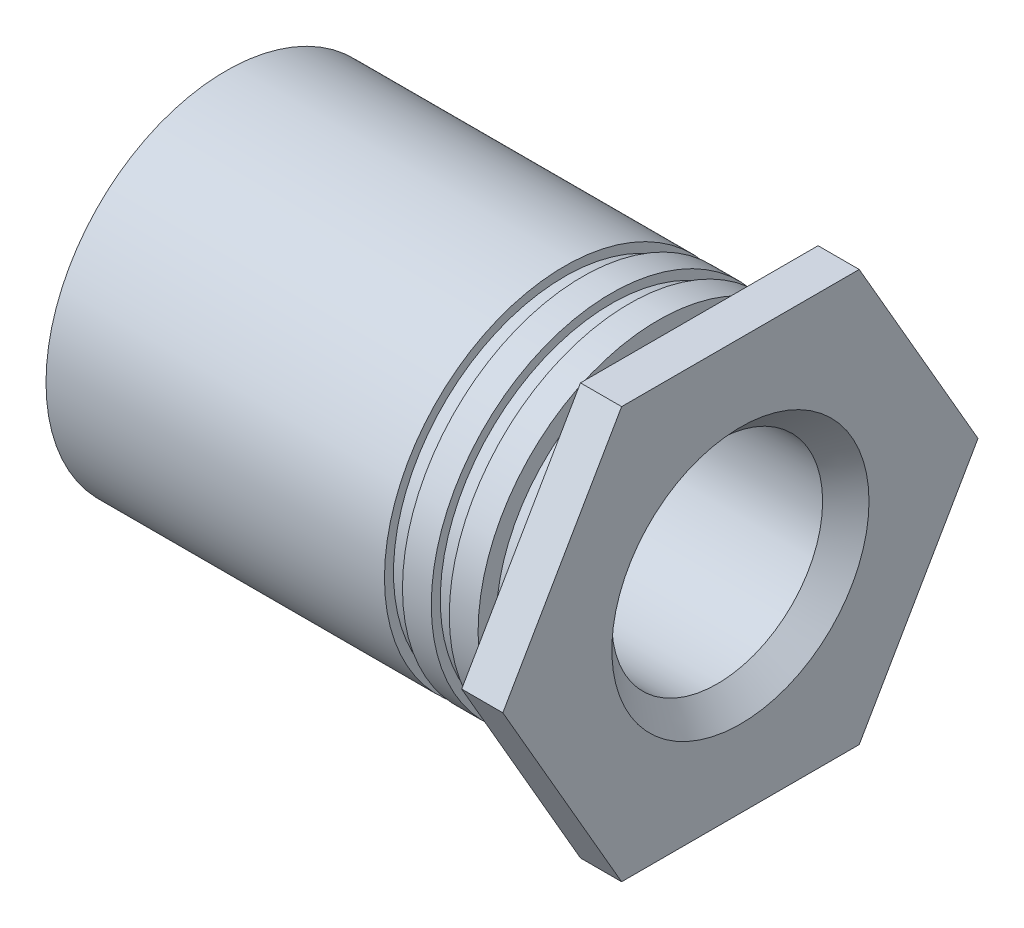
ISO-10303-21;
HEADER;
FILE_DESCRIPTION(('STEP AP214'),'2;1');
FILE_NAME('part.step','',(''),(''),'','','');
FILE_SCHEMA(('AUTOMOTIVE_DESIGN { 1 0 10303 214 1 1 1 1 }'));
ENDSEC;
DATA;
#1=APPLICATION_CONTEXT('core data for automotive mechanical design processes');
#2=APPLICATION_PROTOCOL_DEFINITION('international standard','automotive_design',2000,#1);
#3=PRODUCT_CONTEXT('',#1,'mechanical');
#4=PRODUCT('Part','Part','',(#3));
#5=PRODUCT_RELATED_PRODUCT_CATEGORY('part','',(#4));
#6=PRODUCT_DEFINITION_FORMATION('','',#4);
#7=PRODUCT_DEFINITION_CONTEXT('part definition',#1,'design');
#8=PRODUCT_DEFINITION('design','',#6,#7);
#9=PRODUCT_DEFINITION_SHAPE('','',#8);
#10=(LENGTH_UNIT() NAMED_UNIT(*) SI_UNIT(.MILLI.,.METRE.));
#11=(NAMED_UNIT(*) PLANE_ANGLE_UNIT() SI_UNIT($,.RADIAN.));
#12=(NAMED_UNIT(*) SI_UNIT($,.STERADIAN.) SOLID_ANGLE_UNIT());
#13=UNCERTAINTY_MEASURE_WITH_UNIT(LENGTH_MEASURE(1.E-05),#10,'distance_accuracy_value','');
#14=(GEOMETRIC_REPRESENTATION_CONTEXT(3) GLOBAL_UNCERTAINTY_ASSIGNED_CONTEXT((#13)) GLOBAL_UNIT_ASSIGNED_CONTEXT((#10,
#11,#12)) REPRESENTATION_CONTEXT('',''));
#15=CARTESIAN_POINT('',(0.,0.,0.));
#16=DIRECTION('',(0.,0.,1.));
#17=DIRECTION('',(1.,0.,0.));
#18=AXIS2_PLACEMENT_3D('',#15,#16,#17);
#19=CARTESIAN_POINT('',(-0.48,0.,1.05));
#20=DIRECTION('',(1.,0.,0.));
#21=DIRECTION('',(0.,0.,-1.));
#22=AXIS2_PLACEMENT_3D('',#19,#20,#21);
#23=PLANE('',#22);
#24=CARTESIAN_POINT('',(-0.48,0.,0.));
#25=DIRECTION('',(1.,0.,0.));
#26=DIRECTION('',(0.,0.,-1.));
#27=AXIS2_PLACEMENT_3D('',#24,#25,#26);
#28=CIRCLE('',#27,2.1);
#29=CARTESIAN_POINT('',(-0.48,0.,-2.1));
#30=VERTEX_POINT('',#29);
#31=EDGE_CURVE('E19',#30,#30,#28,.F.);
#32=ORIENTED_EDGE('',*,*,#31,.F.);
#33=EDGE_LOOP('',(#32));
#34=FACE_BOUND('',#33,.T.);
#35=CARTESIAN_POINT('',(-0.48,0.,0.));
#36=DIRECTION('',(1.,0.,0.));
#37=DIRECTION('',(0.,0.,-1.));
#38=AXIS2_PLACEMENT_3D('',#35,#36,#37);
#39=CIRCLE('',#38,1.89);
#40=CARTESIAN_POINT('',(-0.479999999999999,0.,-1.89));
#41=VERTEX_POINT('',#40);
#42=EDGE_CURVE('E129',#41,#41,#39,.T.);
#43=ORIENTED_EDGE('',*,*,#42,.F.);
#44=EDGE_LOOP('',(#43));
#45=FACE_BOUND('',#44,.T.);
#46=ADVANCED_FACE('F16',(#34,#45),#23,.T.);
#47=CARTESIAN_POINT('',(-3.,0.,0.));
#48=DIRECTION('',(1.,0.,0.));
#49=DIRECTION('',(0.,0.,-1.));
#50=AXIS2_PLACEMENT_3D('',#47,#48,#49);
#51=CYLINDRICAL_SURFACE('',#50,2.1);
#52=CARTESIAN_POINT('',(-0.816,0.,0.));
#53=DIRECTION('',(1.,0.,0.));
#54=DIRECTION('',(0.,0.,-1.));
#55=AXIS2_PLACEMENT_3D('',#52,#53,#54);
#56=CIRCLE('',#55,2.1);
#57=CARTESIAN_POINT('',(-0.816,0.,-2.1));
#58=VERTEX_POINT('',#57);
#59=EDGE_CURVE('E127',#58,#58,#56,.T.);
#60=ORIENTED_EDGE('',*,*,#59,.T.);
#61=EDGE_LOOP('',(#60));
#62=FACE_BOUND('',#61,.T.);
#63=ORIENTED_EDGE('',*,*,#31,.T.);
#64=EDGE_LOOP('',(#63));
#65=FACE_BOUND('',#64,.T.);
#66=ADVANCED_FACE('F136',(#62,#65),#51,.T.);
#67=CARTESIAN_POINT('',(-0.24,0.,0.));
#68=DIRECTION('',(1.,0.,0.));
#69=DIRECTION('',(0.,0.,-1.));
#70=AXIS2_PLACEMENT_3D('',#67,#68,#69);
#71=CYLINDRICAL_SURFACE('',#70,1.89);
#72=ORIENTED_EDGE('',*,*,#42,.T.);
#73=EDGE_LOOP('',(#72));
#74=FACE_BOUND('',#73,.T.);
#75=CARTESIAN_POINT('',(0.,0.,0.));
#76=DIRECTION('',(1.,0.,0.));
#77=DIRECTION('',(0.,0.,-1.));
#78=AXIS2_PLACEMENT_3D('',#75,#76,#77);
#79=CIRCLE('',#78,1.89);
#80=CARTESIAN_POINT('',(0.,0.,-1.89));
#81=VERTEX_POINT('',#80);
#82=EDGE_CURVE('E124',#81,#81,#79,.F.);
#83=ORIENTED_EDGE('',*,*,#82,.T.);
#84=EDGE_LOOP('',(#83));
#85=FACE_BOUND('',#84,.T.);
#86=ADVANCED_FACE('F144',(#74,#85),#71,.T.);
#87=CARTESIAN_POINT('',(-0.816000000000001,0.,2.0475));
#88=DIRECTION('',(1.,0.,0.));
#89=DIRECTION('',(0.,0.,-1.));
#90=AXIS2_PLACEMENT_3D('',#87,#88,#89);
#91=PLANE('',#90);
#92=ORIENTED_EDGE('',*,*,#59,.F.);
#93=EDGE_LOOP('',(#92));
#94=FACE_BOUND('',#93,.T.);
#95=CARTESIAN_POINT('',(-0.816,0.,0.));
#96=DIRECTION('',(1.,0.,0.));
#97=DIRECTION('',(0.,0.,-1.));
#98=AXIS2_PLACEMENT_3D('',#95,#96,#97);
#99=CIRCLE('',#98,1.995);
#100=CARTESIAN_POINT('',(-0.816,0.,-1.995));
#101=VERTEX_POINT('',#100);
#102=EDGE_CURVE('E80',#101,#101,#99,.F.);
#103=ORIENTED_EDGE('',*,*,#102,.F.);
#104=EDGE_LOOP('',(#103));
#105=FACE_BOUND('',#104,.T.);
#106=ADVANCED_FACE('F219',(#94,#105),#91,.F.);
#107=CARTESIAN_POINT('',(0.,0.,0.));
#108=DIRECTION('',(1.,0.,0.));
#109=DIRECTION('',(0.,1.,0.));
#110=AXIS2_PLACEMENT_3D('',#107,#108,#109);
#111=PLANE('',#110);
#112=ORIENTED_EDGE('',*,*,#82,.F.);
#113=EDGE_LOOP('',(#112));
#114=FACE_BOUND('',#113,.T.);
#115=DIRECTION('',(0.,0.,1.));
#116=VECTOR('',#115,1.);
#117=CARTESIAN_POINT('',(0.,2.4,1.3856406460551));
#118=LINE('',#117,#116);
#119=CARTESIAN_POINT('',(0.,2.4,-1.3856406460551));
#120=VERTEX_POINT('',#119);
#121=CARTESIAN_POINT('',(0.,2.4,1.3856406460551));
#122=VERTEX_POINT('',#121);
#123=EDGE_CURVE('E71',#120,#122,#118,.T.);
#124=ORIENTED_EDGE('',*,*,#123,.F.);
#125=DIRECTION('',(0.,0.866025403784439,0.5));
#126=VECTOR('',#125,1.);
#127=CARTESIAN_POINT('',(0.,2.4,-1.3856406460551));
#128=LINE('',#127,#126);
#129=CARTESIAN_POINT('',(0.,0.,-2.7712812921102));
#130=VERTEX_POINT('',#129);
#131=EDGE_CURVE('E420',#130,#120,#128,.T.);
#132=ORIENTED_EDGE('',*,*,#131,.F.);
#133=DIRECTION('',(0.,0.866025403784438,-0.5));
#134=VECTOR('',#133,1.);
#135=CARTESIAN_POINT('',(0.,0.,-2.7712812921102));
#136=LINE('',#135,#134);
#137=CARTESIAN_POINT('',(0.,-2.4,-1.3856406460551));
#138=VERTEX_POINT('',#137);
#139=EDGE_CURVE('E408',#138,#130,#136,.T.);
#140=ORIENTED_EDGE('',*,*,#139,.F.);
#141=DIRECTION('',(0.,0.,-1.));
#142=VECTOR('',#141,1.);
#143=CARTESIAN_POINT('',(0.,-2.4,-1.3856406460551));
#144=LINE('',#143,#142);
#145=CARTESIAN_POINT('',(0.,-2.4,1.3856406460551));
#146=VERTEX_POINT('',#145);
#147=EDGE_CURVE('E407',#146,#138,#144,.T.);
#148=ORIENTED_EDGE('',*,*,#147,.F.);
#149=DIRECTION('',(0.,-0.866025403784439,-0.5));
#150=VECTOR('',#149,1.);
#151=CARTESIAN_POINT('',(0.,-2.4,1.3856406460551));
#152=LINE('',#151,#150);
#153=CARTESIAN_POINT('',(0.,0.,2.7712812921102));
#154=VERTEX_POINT('',#153);
#155=EDGE_CURVE('E84',#154,#146,#152,.T.);
#156=ORIENTED_EDGE('',*,*,#155,.F.);
#157=DIRECTION('',(0.,-0.866025403784439,0.5));
#158=VECTOR('',#157,1.);
#159=CARTESIAN_POINT('',(0.,0.,2.7712812921102));
#160=LINE('',#159,#158);
#161=EDGE_CURVE('E66',#122,#154,#160,.T.);
#162=ORIENTED_EDGE('',*,*,#161,.F.);
#163=EDGE_LOOP('',(#124,#132,#140,#148,#156,#162));
#164=FACE_BOUND('',#163,.T.);
#165=ADVANCED_FACE('F82',(#114,#164),#111,.F.);
#166=CARTESIAN_POINT('',(-0.921,0.,0.));
#167=DIRECTION('',(1.,0.,0.));
#168=DIRECTION('',(0.,0.,-1.));
#169=AXIS2_PLACEMENT_3D('',#166,#167,#168);
#170=CYLINDRICAL_SURFACE('',#169,1.995);
#171=CARTESIAN_POINT('',(-1.026,0.,0.));
#172=DIRECTION('',(1.,0.,0.));
#173=DIRECTION('',(0.,0.,-1.));
#174=AXIS2_PLACEMENT_3D('',#171,#172,#173);
#175=CIRCLE('',#174,1.995);
#176=CARTESIAN_POINT('',(-1.026,0.,-1.995));
#177=VERTEX_POINT('',#176);
#178=EDGE_CURVE('E118',#177,#177,#175,.T.);
#179=ORIENTED_EDGE('',*,*,#178,.T.);
#180=EDGE_LOOP('',(#179));
#181=FACE_BOUND('',#180,.T.);
#182=ORIENTED_EDGE('',*,*,#102,.T.);
#183=EDGE_LOOP('',(#182));
#184=FACE_BOUND('',#183,.T.);
#185=ADVANCED_FACE('F213',(#181,#184),#170,.T.);
#186=CARTESIAN_POINT('',(0.,2.4,1.3856406460551));
#187=DIRECTION('',(0.,1.,0.));
#188=DIRECTION('',(0.,0.,1.));
#189=AXIS2_PLACEMENT_3D('',#186,#187,#188);
#190=PLANE('',#189);
#191=ORIENTED_EDGE('',*,*,#123,.T.);
#192=DIRECTION('',(1.,0.,0.));
#193=VECTOR('',#192,1.);
#194=CARTESIAN_POINT('',(0.,2.4,1.3856406460551));
#195=LINE('',#194,#193);
#196=CARTESIAN_POINT('',(0.48,2.4,1.3856406460551));
#197=VERTEX_POINT('',#196);
#198=EDGE_CURVE('E73',#197,#122,#195,.F.);
#199=ORIENTED_EDGE('',*,*,#198,.F.);
#200=DIRECTION('',(0.,0.,1.));
#201=VECTOR('',#200,1.);
#202=CARTESIAN_POINT('',(0.48,2.4,0.));
#203=LINE('',#202,#201);
#204=CARTESIAN_POINT('',(0.48,2.4,-1.3856406460551));
#205=VERTEX_POINT('',#204);
#206=EDGE_CURVE('E121',#205,#197,#203,.T.);
#207=ORIENTED_EDGE('',*,*,#206,.F.);
#208=DIRECTION('',(1.,0.,0.));
#209=VECTOR('',#208,1.);
#210=CARTESIAN_POINT('',(0.,2.4,-1.3856406460551));
#211=LINE('',#210,#209);
#212=EDGE_CURVE('E76',#120,#205,#211,.T.);
#213=ORIENTED_EDGE('',*,*,#212,.F.);
#214=EDGE_LOOP('',(#191,#199,#207,#213));
#215=FACE_BOUND('',#214,.T.);
#216=ADVANCED_FACE('F72',(#215),#190,.T.);
#217=CARTESIAN_POINT('',(0.,0.,2.7712812921102));
#218=DIRECTION('',(0.,0.5,0.866025403784439));
#219=DIRECTION('',(0.,-0.866025403784439,0.5));
#220=AXIS2_PLACEMENT_3D('',#217,#218,#219);
#221=PLANE('',#220);
#222=ORIENTED_EDGE('',*,*,#161,.T.);
#223=DIRECTION('',(1.,0.,0.));
#224=VECTOR('',#223,1.);
#225=CARTESIAN_POINT('',(0.,0.,2.7712812921102));
#226=LINE('',#225,#224);
#227=CARTESIAN_POINT('',(0.48,0.,2.7712812921102));
#228=VERTEX_POINT('',#227);
#229=EDGE_CURVE('E86',#228,#154,#226,.F.);
#230=ORIENTED_EDGE('',*,*,#229,.F.);
#231=DIRECTION('',(0.,-0.866025403784439,0.5));
#232=VECTOR('',#231,1.);
#233=CARTESIAN_POINT('',(0.48,2.4,1.3856406460551));
#234=LINE('',#233,#232);
#235=EDGE_CURVE('E90',#197,#228,#234,.T.);
#236=ORIENTED_EDGE('',*,*,#235,.F.);
#237=ORIENTED_EDGE('',*,*,#198,.T.);
#238=EDGE_LOOP('',(#222,#230,#236,#237));
#239=FACE_BOUND('',#238,.T.);
#240=ADVANCED_FACE('F88',(#239),#221,.T.);
#241=CARTESIAN_POINT('',(0.,-2.4,1.3856406460551));
#242=DIRECTION('',(0.,-0.5,0.866025403784439));
#243=DIRECTION('',(0.,-0.866025403784439,-0.5));
#244=AXIS2_PLACEMENT_3D('',#241,#242,#243);
#245=PLANE('',#244);
#246=ORIENTED_EDGE('',*,*,#155,.T.);
#247=DIRECTION('',(1.,0.,0.));
#248=VECTOR('',#247,1.);
#249=CARTESIAN_POINT('',(0.,-2.4,1.3856406460551));
#250=LINE('',#249,#248);
#251=CARTESIAN_POINT('',(0.48,-2.4,1.3856406460551));
#252=VERTEX_POINT('',#251);
#253=EDGE_CURVE('E403',#252,#146,#250,.F.);
#254=ORIENTED_EDGE('',*,*,#253,.F.);
#255=DIRECTION('',(0.,-0.866025403784439,-0.5));
#256=VECTOR('',#255,1.);
#257=CARTESIAN_POINT('',(0.48,0.,2.7712812921102));
#258=LINE('',#257,#256);
#259=EDGE_CURVE('E425',#228,#252,#258,.T.);
#260=ORIENTED_EDGE('',*,*,#259,.F.);
#261=ORIENTED_EDGE('',*,*,#229,.T.);
#262=EDGE_LOOP('',(#246,#254,#260,#261));
#263=FACE_BOUND('',#262,.T.);
#264=ADVANCED_FACE('F204',(#263),#245,.T.);
#265=CARTESIAN_POINT('',(0.,-2.4,-1.3856406460551));
#266=DIRECTION('',(0.,-1.,0.));
#267=DIRECTION('',(0.,0.,-1.));
#268=AXIS2_PLACEMENT_3D('',#265,#266,#267);
#269=PLANE('',#268);
#270=ORIENTED_EDGE('',*,*,#147,.T.);
#271=DIRECTION('',(1.,0.,0.));
#272=VECTOR('',#271,1.);
#273=CARTESIAN_POINT('',(0.,-2.4,-1.3856406460551));
#274=LINE('',#273,#272);
#275=CARTESIAN_POINT('',(0.48,-2.4,-1.3856406460551));
#276=VERTEX_POINT('',#275);
#277=EDGE_CURVE('E410',#276,#138,#274,.F.);
#278=ORIENTED_EDGE('',*,*,#277,.F.);
#279=DIRECTION('',(0.,0.,1.));
#280=VECTOR('',#279,1.);
#281=CARTESIAN_POINT('',(0.48,-2.4,0.));
#282=LINE('',#281,#280);
#283=EDGE_CURVE('E413',#252,#276,#282,.F.);
#284=ORIENTED_EDGE('',*,*,#283,.F.);
#285=ORIENTED_EDGE('',*,*,#253,.T.);
#286=EDGE_LOOP('',(#270,#278,#284,#285));
#287=FACE_BOUND('',#286,.T.);
#288=ADVANCED_FACE('F201',(#287),#269,.T.);
#289=CARTESIAN_POINT('',(0.,0.,-2.7712812921102));
#290=DIRECTION('',(0.,-0.5,-0.866025403784438));
#291=DIRECTION('',(0.,0.866025403784438,-0.5));
#292=AXIS2_PLACEMENT_3D('',#289,#290,#291);
#293=PLANE('',#292);
#294=ORIENTED_EDGE('',*,*,#139,.T.);
#295=DIRECTION('',(1.,0.,0.));
#296=VECTOR('',#295,1.);
#297=CARTESIAN_POINT('',(0.,0.,-2.7712812921102));
#298=LINE('',#297,#296);
#299=CARTESIAN_POINT('',(0.48,0.,-2.7712812921102));
#300=VERTEX_POINT('',#299);
#301=EDGE_CURVE('E34',#300,#130,#298,.F.);
#302=ORIENTED_EDGE('',*,*,#301,.F.);
#303=DIRECTION('',(0.,0.866025403784439,-0.5));
#304=VECTOR('',#303,1.);
#305=CARTESIAN_POINT('',(0.48,-2.4,-1.3856406460551));
#306=LINE('',#305,#304);
#307=EDGE_CURVE('E428',#276,#300,#306,.T.);
#308=ORIENTED_EDGE('',*,*,#307,.F.);
#309=ORIENTED_EDGE('',*,*,#277,.T.);
#310=EDGE_LOOP('',(#294,#302,#308,#309));
#311=FACE_BOUND('',#310,.T.);
#312=ADVANCED_FACE('F197',(#311),#293,.T.);
#313=CARTESIAN_POINT('',(0.,2.4,-1.3856406460551));
#314=DIRECTION('',(0.,0.5,-0.866025403784439));
#315=DIRECTION('',(0.,0.866025403784439,0.5));
#316=AXIS2_PLACEMENT_3D('',#313,#314,#315);
#317=PLANE('',#316);
#318=ORIENTED_EDGE('',*,*,#131,.T.);
#319=ORIENTED_EDGE('',*,*,#212,.T.);
#320=DIRECTION('',(0.,0.866025403784439,0.499999999999999));
#321=VECTOR('',#320,1.);
#322=CARTESIAN_POINT('',(0.48,0.,-2.7712812921102));
#323=LINE('',#322,#321);
#324=EDGE_CURVE('E117',#300,#205,#323,.T.);
#325=ORIENTED_EDGE('',*,*,#324,.F.);
#326=ORIENTED_EDGE('',*,*,#301,.T.);
#327=EDGE_LOOP('',(#318,#319,#325,#326));
#328=FACE_BOUND('',#327,.T.);
#329=ADVANCED_FACE('F193',(#328),#317,.T.);
#330=CARTESIAN_POINT('',(-1.026,0.,2.0475));
#331=DIRECTION('',(-1.,0.,0.));
#332=DIRECTION('',(0.,0.,1.));
#333=AXIS2_PLACEMENT_3D('',#330,#331,#332);
#334=PLANE('',#333);
#335=ORIENTED_EDGE('',*,*,#178,.F.);
#336=EDGE_LOOP('',(#335));
#337=FACE_BOUND('',#336,.T.);
#338=CARTESIAN_POINT('',(-1.026,0.,0.));
#339=DIRECTION('',(1.,0.,0.));
#340=DIRECTION('',(0.,0.,-1.));
#341=AXIS2_PLACEMENT_3D('',#338,#339,#340);
#342=CIRCLE('',#341,2.1);
#343=CARTESIAN_POINT('',(-1.026,0.,-2.1));
#344=VERTEX_POINT('',#343);
#345=EDGE_CURVE('E114',#344,#344,#342,.F.);
#346=ORIENTED_EDGE('',*,*,#345,.F.);
#347=EDGE_LOOP('',(#346));
#348=FACE_BOUND('',#347,.T.);
#349=ADVANCED_FACE('F189',(#337,#348),#334,.F.);
#350=CARTESIAN_POINT('',(0.48,0.,0.));
#351=DIRECTION('',(1.,0.,0.));
#352=DIRECTION('',(0.,1.,0.));
#353=AXIS2_PLACEMENT_3D('',#350,#351,#352);
#354=PLANE('',#353);
#355=ORIENTED_EDGE('',*,*,#307,.T.);
#356=ORIENTED_EDGE('',*,*,#324,.T.);
#357=ORIENTED_EDGE('',*,*,#206,.T.);
#358=ORIENTED_EDGE('',*,*,#235,.T.);
#359=ORIENTED_EDGE('',*,*,#259,.T.);
#360=ORIENTED_EDGE('',*,*,#283,.T.);
#361=EDGE_LOOP('',(#355,#356,#357,#358,#359,#360));
#362=FACE_BOUND('',#361,.T.);
#363=CARTESIAN_POINT('',(0.479999999981828,0.,0.));
#364=DIRECTION('',(1.,0.,0.));
#365=DIRECTION('',(0.,0.,-1.));
#366=AXIS2_PLACEMENT_3D('',#363,#364,#365);
#367=CIRCLE('',#366,1.49999999996453);
#368=CARTESIAN_POINT('',(0.479999999981828,0.,-1.49999999996453));
#369=VERTEX_POINT('',#368);
#370=EDGE_CURVE('E111',#369,#369,#367,.F.);
#371=ORIENTED_EDGE('',*,*,#370,.T.);
#372=EDGE_LOOP('',(#371));
#373=FACE_BOUND('',#372,.T.);
#374=ADVANCED_FACE('F185',(#362,#373),#354,.T.);
#375=CARTESIAN_POINT('',(-3.,0.,0.));
#376=DIRECTION('',(1.,0.,0.));
#377=DIRECTION('',(0.,0.,-1.));
#378=AXIS2_PLACEMENT_3D('',#375,#376,#377);
#379=CYLINDRICAL_SURFACE('',#378,2.1);
#380=CARTESIAN_POINT('',(-1.362,0.,0.));
#381=DIRECTION('',(1.,0.,0.));
#382=DIRECTION('',(0.,0.,-1.));
#383=AXIS2_PLACEMENT_3D('',#380,#381,#382);
#384=CIRCLE('',#383,2.1);
#385=CARTESIAN_POINT('',(-1.362,0.,-2.1));
#386=VERTEX_POINT('',#385);
#387=EDGE_CURVE('E108',#386,#386,#384,.T.);
#388=ORIENTED_EDGE('',*,*,#387,.T.);
#389=EDGE_LOOP('',(#388));
#390=FACE_BOUND('',#389,.T.);
#391=ORIENTED_EDGE('',*,*,#345,.T.);
#392=EDGE_LOOP('',(#391));
#393=FACE_BOUND('',#392,.T.);
#394=ADVANCED_FACE('F181',(#390,#393),#379,.T.);
#395=CARTESIAN_POINT('',(0.479999999981828,0.,0.));
#396=DIRECTION('',(1.,0.,0.));
#397=DIRECTION('',(0.,0.,-1.));
#398=AXIS2_PLACEMENT_3D('',#395,#396,#397);
#399=CONICAL_SURFACE('',#398,1.49999999996453,0.785398163397448);
#400=ORIENTED_EDGE('',*,*,#370,.F.);
#401=EDGE_LOOP('',(#400));
#402=FACE_BOUND('',#401,.T.);
#403=CARTESIAN_POINT('',(0.2095,0.,0.));
#404=DIRECTION('',(1.,0.,0.));
#405=DIRECTION('',(0.,0.,-1.));
#406=AXIS2_PLACEMENT_3D('',#403,#404,#405);
#407=CIRCLE('',#406,1.2295);
#408=CARTESIAN_POINT('',(0.2095,0.,-1.2295));
#409=VERTEX_POINT('',#408);
#410=EDGE_CURVE('E107',#409,#409,#407,.F.);
#411=ORIENTED_EDGE('',*,*,#410,.T.);
#412=EDGE_LOOP('',(#411));
#413=FACE_BOUND('',#412,.T.);
#414=ADVANCED_FACE('F177',(#402,#413),#399,.F.);
#415=CARTESIAN_POINT('',(-1.362,0.,2.0475));
#416=DIRECTION('',(1.,0.,0.));
#417=DIRECTION('',(0.,0.,-1.));
#418=AXIS2_PLACEMENT_3D('',#415,#416,#417);
#419=PLANE('',#418);
#420=ORIENTED_EDGE('',*,*,#387,.F.);
#421=EDGE_LOOP('',(#420));
#422=FACE_BOUND('',#421,.T.);
#423=CARTESIAN_POINT('',(-1.362,0.,0.));
#424=DIRECTION('',(1.,0.,0.));
#425=DIRECTION('',(0.,0.,-1.));
#426=AXIS2_PLACEMENT_3D('',#423,#424,#425);
#427=CIRCLE('',#426,1.995);
#428=CARTESIAN_POINT('',(-1.362,0.,-1.995));
#429=VERTEX_POINT('',#428);
#430=EDGE_CURVE('E104',#429,#429,#427,.F.);
#431=ORIENTED_EDGE('',*,*,#430,.F.);
#432=EDGE_LOOP('',(#431));
#433=FACE_BOUND('',#432,.T.);
#434=ADVANCED_FACE('F173',(#422,#433),#419,.F.);
#435=CARTESIAN_POINT('',(-2.52,0.,0.));
#436=DIRECTION('',(1.,0.,0.));
#437=DIRECTION('',(0.,0.,-1.));
#438=AXIS2_PLACEMENT_3D('',#435,#436,#437);
#439=CYLINDRICAL_SURFACE('',#438,1.2295);
#440=ORIENTED_EDGE('',*,*,#410,.F.);
#441=EDGE_LOOP('',(#440));
#442=FACE_BOUND('',#441,.T.);
#443=CARTESIAN_POINT('',(-5.24950000004765,0.,0.));
#444=DIRECTION('',(-1.,0.,0.));
#445=DIRECTION('',(0.,0.,-1.));
#446=AXIS2_PLACEMENT_3D('',#443,#444,#445);
#447=CIRCLE('',#446,1.2295000000222);
#448=CARTESIAN_POINT('',(-5.24950000004765,0.,-1.2295000000222));
#449=VERTEX_POINT('',#448);
#450=EDGE_CURVE('E103',#449,#449,#447,.T.);
#451=ORIENTED_EDGE('',*,*,#450,.T.);
#452=EDGE_LOOP('',(#451));
#453=FACE_BOUND('',#452,.T.);
#454=ADVANCED_FACE('F169',(#442,#453),#439,.F.);
#455=CARTESIAN_POINT('',(-1.467,0.,0.));
#456=DIRECTION('',(1.,0.,0.));
#457=DIRECTION('',(0.,0.,-1.));
#458=AXIS2_PLACEMENT_3D('',#455,#456,#457);
#459=CYLINDRICAL_SURFACE('',#458,1.995);
#460=CARTESIAN_POINT('',(-1.572,0.,0.));
#461=DIRECTION('',(1.,0.,0.));
#462=DIRECTION('',(0.,0.,-1.));
#463=AXIS2_PLACEMENT_3D('',#460,#461,#462);
#464=CIRCLE('',#463,1.995);
#465=CARTESIAN_POINT('',(-1.572,0.,-1.995));
#466=VERTEX_POINT('',#465);
#467=EDGE_CURVE('E100',#466,#466,#464,.T.);
#468=ORIENTED_EDGE('',*,*,#467,.T.);
#469=EDGE_LOOP('',(#468));
#470=FACE_BOUND('',#469,.T.);
#471=ORIENTED_EDGE('',*,*,#430,.T.);
#472=EDGE_LOOP('',(#471));
#473=FACE_BOUND('',#472,.T.);
#474=ADVANCED_FACE('F165',(#470,#473),#459,.T.);
#475=CARTESIAN_POINT('',(-5.52000000004682,0.,0.));
#476=DIRECTION('',(-1.,0.,0.));
#477=DIRECTION('',(0.,0.,1.));
#478=AXIS2_PLACEMENT_3D('',#475,#476,#477);
#479=CONICAL_SURFACE('',#478,1.50000000002137,0.785398163397446);
#480=ORIENTED_EDGE('',*,*,#450,.F.);
#481=EDGE_LOOP('',(#480));
#482=FACE_BOUND('',#481,.T.);
#483=CARTESIAN_POINT('',(-5.52000000004682,0.,0.));
#484=DIRECTION('',(-1.,0.,0.));
#485=DIRECTION('',(0.,0.,1.));
#486=AXIS2_PLACEMENT_3D('',#483,#484,#485);
#487=CIRCLE('',#486,1.50000000002137);
#488=CARTESIAN_POINT('',(-5.52000000004682,0.,1.50000000002137));
#489=VERTEX_POINT('',#488);
#490=EDGE_CURVE('E97',#489,#489,#487,.F.);
#491=ORIENTED_EDGE('',*,*,#490,.F.);
#492=EDGE_LOOP('',(#491));
#493=FACE_BOUND('',#492,.T.);
#494=ADVANCED_FACE('F161',(#482,#493),#479,.F.);
#495=CARTESIAN_POINT('',(-1.572,0.,2.0475));
#496=DIRECTION('',(-1.,0.,0.));
#497=DIRECTION('',(0.,0.,1.));
#498=AXIS2_PLACEMENT_3D('',#495,#496,#497);
#499=PLANE('',#498);
#500=ORIENTED_EDGE('',*,*,#467,.F.);
#501=EDGE_LOOP('',(#500));
#502=FACE_BOUND('',#501,.T.);
#503=CARTESIAN_POINT('',(-1.572,0.,0.));
#504=DIRECTION('',(1.,0.,0.));
#505=DIRECTION('',(0.,0.,-1.));
#506=AXIS2_PLACEMENT_3D('',#503,#504,#505);
#507=CIRCLE('',#506,2.1);
#508=CARTESIAN_POINT('',(-1.572,0.,-2.1));
#509=VERTEX_POINT('',#508);
#510=EDGE_CURVE('E25',#509,#509,#507,.F.);
#511=ORIENTED_EDGE('',*,*,#510,.F.);
#512=EDGE_LOOP('',(#511));
#513=FACE_BOUND('',#512,.T.);
#514=ADVANCED_FACE('F154',(#502,#513),#499,.F.);
#515=CARTESIAN_POINT('',(-5.52,0.,1.05));
#516=DIRECTION('',(-1.,0.,0.));
#517=DIRECTION('',(0.,0.,1.));
#518=AXIS2_PLACEMENT_3D('',#515,#516,#517);
#519=PLANE('',#518);
#520=CARTESIAN_POINT('',(-5.52,0.,0.));
#521=DIRECTION('',(1.,0.,0.));
#522=DIRECTION('',(0.,0.,-1.));
#523=AXIS2_PLACEMENT_3D('',#520,#521,#522);
#524=CIRCLE('',#523,2.1);
#525=CARTESIAN_POINT('',(-5.52,0.,-2.1));
#526=VERTEX_POINT('',#525);
#527=EDGE_CURVE('E10',#526,#526,#524,.T.);
#528=ORIENTED_EDGE('',*,*,#527,.F.);
#529=EDGE_LOOP('',(#528));
#530=FACE_BOUND('',#529,.T.);
#531=ORIENTED_EDGE('',*,*,#490,.T.);
#532=EDGE_LOOP('',(#531));
#533=FACE_BOUND('',#532,.T.);
#534=ADVANCED_FACE('F148',(#530,#533),#519,.T.);
#535=CARTESIAN_POINT('',(-3.,0.,0.));
#536=DIRECTION('',(1.,0.,0.));
#537=DIRECTION('',(0.,0.,-1.));
#538=AXIS2_PLACEMENT_3D('',#535,#536,#537);
#539=CYLINDRICAL_SURFACE('',#538,2.1);
#540=ORIENTED_EDGE('',*,*,#510,.T.);
#541=EDGE_LOOP('',(#540));
#542=FACE_BOUND('',#541,.T.);
#543=ORIENTED_EDGE('',*,*,#527,.T.);
#544=EDGE_LOOP('',(#543));
#545=FACE_BOUND('',#544,.T.);
#546=ADVANCED_FACE('F146',(#542,#545),#539,.T.);
#547=CLOSED_SHELL('',(#46,#66,#86,#106,#165,#185,#216,#240,#264,#288,#312,#329,#349,#374,#394,
#414,#434,#454,#474,#494,#514,#534,#546));
#548=MANIFOLD_SOLID_BREP('B1',#547);
#549=ADVANCED_BREP_SHAPE_REPRESENTATION('',(#18,#548),#14);
#550=SHAPE_DEFINITION_REPRESENTATION(#9,#549);
ENDSEC;
END-ISO-10303-21;
